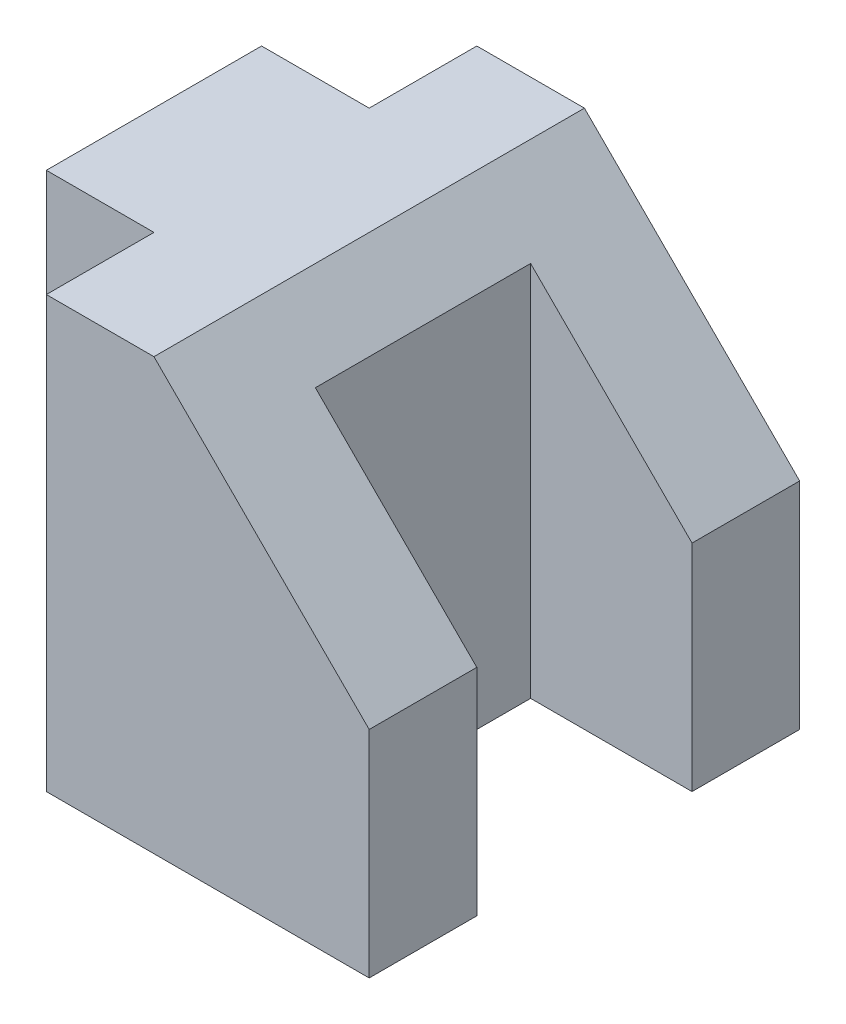
ISO-10303-21;
HEADER;
FILE_DESCRIPTION(('STEP AP214'),'2;1');
FILE_NAME('part.step','',(''),(''),'','','');
FILE_SCHEMA(('AUTOMOTIVE_DESIGN { 1 0 10303 214 1 1 1 1 }'));
ENDSEC;
DATA;
#1=APPLICATION_CONTEXT('core data for automotive mechanical design processes');
#2=APPLICATION_PROTOCOL_DEFINITION('international standard','automotive_design',2000,#1);
#3=PRODUCT_CONTEXT('',#1,'mechanical');
#4=PRODUCT('Part','Part','',(#3));
#5=PRODUCT_RELATED_PRODUCT_CATEGORY('part','',(#4));
#6=PRODUCT_DEFINITION_FORMATION('','',#4);
#7=PRODUCT_DEFINITION_CONTEXT('part definition',#1,'design');
#8=PRODUCT_DEFINITION('design','',#6,#7);
#9=PRODUCT_DEFINITION_SHAPE('','',#8);
#10=(LENGTH_UNIT() NAMED_UNIT(*) SI_UNIT(.MILLI.,.METRE.));
#11=(NAMED_UNIT(*) PLANE_ANGLE_UNIT() SI_UNIT($,.RADIAN.));
#12=(NAMED_UNIT(*) SI_UNIT($,.STERADIAN.) SOLID_ANGLE_UNIT());
#13=UNCERTAINTY_MEASURE_WITH_UNIT(LENGTH_MEASURE(1.E-05),#10,'distance_accuracy_value','');
#14=(GEOMETRIC_REPRESENTATION_CONTEXT(3) GLOBAL_UNCERTAINTY_ASSIGNED_CONTEXT((#13)) GLOBAL_UNIT_ASSIGNED_CONTEXT((#10,
#11,#12)) REPRESENTATION_CONTEXT('',''));
#15=CARTESIAN_POINT('',(0.,0.,0.));
#16=DIRECTION('',(0.,0.,1.));
#17=DIRECTION('',(1.,0.,0.));
#18=AXIS2_PLACEMENT_3D('',#15,#16,#17);
#19=CARTESIAN_POINT('',(38.1,101.6,-25.4));
#20=DIRECTION('',(-1.,0.,0.));
#21=DIRECTION('',(0.,0.,1.));
#22=AXIS2_PLACEMENT_3D('',#19,#20,#21);
#23=PLANE('',#22);
#24=DIRECTION('',(0.,-1.,0.));
#25=VECTOR('',#24,1.);
#26=CARTESIAN_POINT('',(38.1,101.6,-25.4));
#27=LINE('',#26,#25);
#28=CARTESIAN_POINT('',(38.1,50.8,-25.4));
#29=VERTEX_POINT('',#28);
#30=CARTESIAN_POINT('',(38.1,0.,-25.4));
#31=VERTEX_POINT('',#30);
#32=EDGE_CURVE('E47',#29,#31,#27,.T.);
#33=ORIENTED_EDGE('',*,*,#32,.F.);
#34=DIRECTION('',(0.,0.,1.));
#35=VECTOR('',#34,1.);
#36=CARTESIAN_POINT('',(38.1,50.8,-101.6));
#37=LINE('',#36,#35);
#38=CARTESIAN_POINT('',(38.1,50.8,0.));
#39=VERTEX_POINT('',#38);
#40=EDGE_CURVE('E273',#29,#39,#37,.T.);
#41=ORIENTED_EDGE('',*,*,#40,.T.);
#42=DIRECTION('',(0.,-1.,0.));
#43=VECTOR('',#42,1.);
#44=CARTESIAN_POINT('',(38.1,101.6,0.));
#45=LINE('',#44,#43);
#46=CARTESIAN_POINT('',(38.1,0.,0.));
#47=VERTEX_POINT('',#46);
#48=EDGE_CURVE('E11',#39,#47,#45,.T.);
#49=ORIENTED_EDGE('',*,*,#48,.T.);
#50=DIRECTION('',(0.,0.,-1.));
#51=VECTOR('',#50,1.);
#52=CARTESIAN_POINT('',(38.1,0.,-25.4));
#53=LINE('',#52,#51);
#54=EDGE_CURVE('E160',#47,#31,#53,.T.);
#55=ORIENTED_EDGE('',*,*,#54,.T.);
#56=EDGE_LOOP('',(#33,#41,#49,#55));
#57=FACE_BOUND('',#56,.T.);
#58=ADVANCED_FACE('F39',(#57),#23,.F.);
#59=CARTESIAN_POINT('',(0.,101.6,-25.4));
#60=DIRECTION('',(0.,0.,1.));
#61=DIRECTION('',(1.,0.,0.));
#62=AXIS2_PLACEMENT_3D('',#59,#60,#61);
#63=PLANE('',#62);
#64=DIRECTION('',(0.,-1.,0.));
#65=VECTOR('',#64,1.);
#66=CARTESIAN_POINT('',(0.,101.6,-25.4));
#67=LINE('',#66,#65);
#68=CARTESIAN_POINT('',(0.,88.9,-25.4));
#69=VERTEX_POINT('',#68);
#70=CARTESIAN_POINT('',(0.,0.,-25.4));
#71=VERTEX_POINT('',#70);
#72=EDGE_CURVE('E224',#69,#71,#67,.T.);
#73=ORIENTED_EDGE('',*,*,#72,.F.);
#74=DIRECTION('',(0.707106781186548,-0.707106781186548,0.));
#75=VECTOR('',#74,1.);
#76=CARTESIAN_POINT('',(-6.34999999999999,95.25,-25.4));
#77=LINE('',#76,#75);
#78=EDGE_CURVE('E165',#69,#29,#77,.T.);
#79=ORIENTED_EDGE('',*,*,#78,.T.);
#80=ORIENTED_EDGE('',*,*,#32,.T.);
#81=DIRECTION('',(-1.,0.,0.));
#82=VECTOR('',#81,1.);
#83=CARTESIAN_POINT('',(0.,0.,-25.4));
#84=LINE('',#83,#82);
#85=EDGE_CURVE('E164',#31,#71,#84,.T.);
#86=ORIENTED_EDGE('',*,*,#85,.T.);
#87=EDGE_LOOP('',(#73,#79,#80,#86));
#88=FACE_BOUND('',#87,.T.);
#89=ADVANCED_FACE('F231',(#88),#63,.F.);
#90=CARTESIAN_POINT('',(0.,101.6,-76.2));
#91=DIRECTION('',(-1.,0.,0.));
#92=DIRECTION('',(0.,0.,1.));
#93=AXIS2_PLACEMENT_3D('',#90,#91,#92);
#94=PLANE('',#93);
#95=DIRECTION('',(0.,-1.,0.));
#96=VECTOR('',#95,1.);
#97=CARTESIAN_POINT('',(0.,101.6,-76.2));
#98=LINE('',#97,#96);
#99=CARTESIAN_POINT('',(0.,88.9,-76.2));
#100=VERTEX_POINT('',#99);
#101=CARTESIAN_POINT('',(0.,0.,-76.2));
#102=VERTEX_POINT('',#101);
#103=EDGE_CURVE('E221',#100,#102,#98,.T.);
#104=ORIENTED_EDGE('',*,*,#103,.F.);
#105=DIRECTION('',(0.,0.,1.));
#106=VECTOR('',#105,1.);
#107=CARTESIAN_POINT('',(0.,88.9,-76.2));
#108=LINE('',#107,#106);
#109=EDGE_CURVE('E251',#100,#69,#108,.T.);
#110=ORIENTED_EDGE('',*,*,#109,.T.);
#111=ORIENTED_EDGE('',*,*,#72,.T.);
#112=DIRECTION('',(0.,0.,-1.));
#113=VECTOR('',#112,1.);
#114=CARTESIAN_POINT('',(0.,0.,-76.2));
#115=LINE('',#114,#113);
#116=EDGE_CURVE('E169',#71,#102,#115,.T.);
#117=ORIENTED_EDGE('',*,*,#116,.T.);
#118=EDGE_LOOP('',(#104,#110,#111,#117));
#119=FACE_BOUND('',#118,.T.);
#120=ADVANCED_FACE('F247',(#119),#94,.F.);
#121=CARTESIAN_POINT('',(38.1,101.6,-76.2));
#122=DIRECTION('',(0.,0.,-1.));
#123=DIRECTION('',(-1.,0.,0.));
#124=AXIS2_PLACEMENT_3D('',#121,#122,#123);
#125=PLANE('',#124);
#126=DIRECTION('',(0.,-1.,0.));
#127=VECTOR('',#126,1.);
#128=CARTESIAN_POINT('',(38.1,101.6,-76.2));
#129=LINE('',#128,#127);
#130=CARTESIAN_POINT('',(38.1,50.8,-76.2));
#131=VERTEX_POINT('',#130);
#132=CARTESIAN_POINT('',(38.1,0.,-76.2));
#133=VERTEX_POINT('',#132);
#134=EDGE_CURVE('E218',#131,#133,#129,.T.);
#135=ORIENTED_EDGE('',*,*,#134,.F.);
#136=DIRECTION('',(-0.707106781186548,0.707106781186548,0.));
#137=VECTOR('',#136,1.);
#138=CARTESIAN_POINT('',(12.7,76.2,-76.2));
#139=LINE('',#138,#137);
#140=EDGE_CURVE('E268',#131,#100,#139,.T.);
#141=ORIENTED_EDGE('',*,*,#140,.T.);
#142=ORIENTED_EDGE('',*,*,#103,.T.);
#143=DIRECTION('',(1.,0.,0.));
#144=VECTOR('',#143,1.);
#145=CARTESIAN_POINT('',(38.1,0.,-76.2));
#146=LINE('',#145,#144);
#147=EDGE_CURVE('E173',#102,#133,#146,.T.);
#148=ORIENTED_EDGE('',*,*,#147,.T.);
#149=EDGE_LOOP('',(#135,#141,#142,#148));
#150=FACE_BOUND('',#149,.T.);
#151=ADVANCED_FACE('F325',(#150),#125,.F.);
#152=CARTESIAN_POINT('',(38.1,101.6,-101.6));
#153=DIRECTION('',(-1.,0.,0.));
#154=DIRECTION('',(0.,0.,1.));
#155=AXIS2_PLACEMENT_3D('',#152,#153,#154);
#156=PLANE('',#155);
#157=DIRECTION('',(0.,-1.,0.));
#158=VECTOR('',#157,1.);
#159=CARTESIAN_POINT('',(38.1,101.6,-101.6));
#160=LINE('',#159,#158);
#161=CARTESIAN_POINT('',(38.1,50.8,-101.6));
#162=VERTEX_POINT('',#161);
#163=CARTESIAN_POINT('',(38.1,0.,-101.6));
#164=VERTEX_POINT('',#163);
#165=EDGE_CURVE('E215',#162,#164,#160,.T.);
#166=ORIENTED_EDGE('',*,*,#165,.F.);
#167=EDGE_CURVE('E266',#162,#131,#37,.T.);
#168=ORIENTED_EDGE('',*,*,#167,.T.);
#169=ORIENTED_EDGE('',*,*,#134,.T.);
#170=DIRECTION('',(0.,0.,-1.));
#171=VECTOR('',#170,1.);
#172=CARTESIAN_POINT('',(38.1,0.,-101.6));
#173=LINE('',#172,#171);
#174=EDGE_CURVE('E177',#133,#164,#173,.T.);
#175=ORIENTED_EDGE('',*,*,#174,.T.);
#176=EDGE_LOOP('',(#166,#168,#169,#175));
#177=FACE_BOUND('',#176,.T.);
#178=ADVANCED_FACE('F281',(#177),#156,.F.);
#179=CARTESIAN_POINT('',(-38.1,101.6,-101.6));
#180=DIRECTION('',(0.,0.,1.));
#181=DIRECTION('',(1.,0.,0.));
#182=AXIS2_PLACEMENT_3D('',#179,#180,#181);
#183=PLANE('',#182);
#184=DIRECTION('',(-1.,0.,0.));
#185=VECTOR('',#184,1.);
#186=CARTESIAN_POINT('',(-38.1,101.6,-101.6));
#187=LINE('',#186,#185);
#188=CARTESIAN_POINT('',(-12.7,101.6,-101.6));
#189=VERTEX_POINT('',#188);
#190=CARTESIAN_POINT('',(-38.1,101.6,-101.6));
#191=VERTEX_POINT('',#190);
#192=EDGE_CURVE('E116',#189,#191,#187,.T.);
#193=ORIENTED_EDGE('',*,*,#192,.F.);
#194=DIRECTION('',(0.707106781186547,-0.707106781186547,0.));
#195=VECTOR('',#194,1.);
#196=CARTESIAN_POINT('',(-12.7,101.6,-101.6));
#197=LINE('',#196,#195);
#198=EDGE_CURVE('E54',#189,#162,#197,.T.);
#199=ORIENTED_EDGE('',*,*,#198,.T.);
#200=ORIENTED_EDGE('',*,*,#165,.T.);
#201=DIRECTION('',(-1.,0.,0.));
#202=VECTOR('',#201,1.);
#203=CARTESIAN_POINT('',(-38.1,0.,-101.6));
#204=LINE('',#203,#202);
#205=CARTESIAN_POINT('',(-38.1,0.,-101.6));
#206=VERTEX_POINT('',#205);
#207=EDGE_CURVE('E181',#164,#206,#204,.T.);
#208=ORIENTED_EDGE('',*,*,#207,.T.);
#209=DIRECTION('',(0.,-1.,0.));
#210=VECTOR('',#209,1.);
#211=CARTESIAN_POINT('',(-38.1,101.6,-101.6));
#212=LINE('',#211,#210);
#213=EDGE_CURVE('E211',#191,#206,#212,.T.);
#214=ORIENTED_EDGE('',*,*,#213,.F.);
#215=EDGE_LOOP('',(#193,#199,#200,#208,#214));
#216=FACE_BOUND('',#215,.T.);
#217=ADVANCED_FACE('F276',(#216),#183,.F.);
#218=CARTESIAN_POINT('',(-38.1,101.6,-76.2));
#219=DIRECTION('',(1.,0.,0.));
#220=DIRECTION('',(0.,0.,-1.));
#221=AXIS2_PLACEMENT_3D('',#218,#219,#220);
#222=PLANE('',#221);
#223=DIRECTION('',(0.,0.,1.));
#224=VECTOR('',#223,1.);
#225=CARTESIAN_POINT('',(-38.1,0.,-76.2));
#226=LINE('',#225,#224);
#227=CARTESIAN_POINT('',(-38.1,0.,-76.2));
#228=VERTEX_POINT('',#227);
#229=EDGE_CURVE('E184',#206,#228,#226,.T.);
#230=ORIENTED_EDGE('',*,*,#229,.T.);
#231=DIRECTION('',(0.,-1.,0.));
#232=VECTOR('',#231,1.);
#233=CARTESIAN_POINT('',(-38.1,101.6,-76.2));
#234=LINE('',#233,#232);
#235=CARTESIAN_POINT('',(-38.1,101.6,-76.2));
#236=VERTEX_POINT('',#235);
#237=EDGE_CURVE('E207',#236,#228,#234,.T.);
#238=ORIENTED_EDGE('',*,*,#237,.F.);
#239=DIRECTION('',(0.,0.,1.));
#240=VECTOR('',#239,1.);
#241=CARTESIAN_POINT('',(-38.1,101.6,-76.2));
#242=LINE('',#241,#240);
#243=EDGE_CURVE('E289',#191,#236,#242,.T.);
#244=ORIENTED_EDGE('',*,*,#243,.F.);
#245=ORIENTED_EDGE('',*,*,#213,.T.);
#246=EDGE_LOOP('',(#230,#238,#244,#245));
#247=FACE_BOUND('',#246,.T.);
#248=ADVANCED_FACE('F287',(#247),#222,.F.);
#249=CARTESIAN_POINT('',(-63.5,101.6,-76.2));
#250=DIRECTION('',(0.,0.,1.));
#251=DIRECTION('',(1.,0.,0.));
#252=AXIS2_PLACEMENT_3D('',#249,#250,#251);
#253=PLANE('',#252);
#254=DIRECTION('',(-1.,0.,0.));
#255=VECTOR('',#254,1.);
#256=CARTESIAN_POINT('',(-63.5,0.,-76.2));
#257=LINE('',#256,#255);
#258=CARTESIAN_POINT('',(-63.5,0.,-76.2));
#259=VERTEX_POINT('',#258);
#260=EDGE_CURVE('E187',#228,#259,#257,.T.);
#261=ORIENTED_EDGE('',*,*,#260,.T.);
#262=DIRECTION('',(0.,-1.,0.));
#263=VECTOR('',#262,1.);
#264=CARTESIAN_POINT('',(-63.5,101.6,-76.2));
#265=LINE('',#264,#263);
#266=CARTESIAN_POINT('',(-63.5,101.6,-76.2));
#267=VERTEX_POINT('',#266);
#268=EDGE_CURVE('E147',#267,#259,#265,.T.);
#269=ORIENTED_EDGE('',*,*,#268,.F.);
#270=DIRECTION('',(-1.,0.,0.));
#271=VECTOR('',#270,1.);
#272=CARTESIAN_POINT('',(-63.5,101.6,-76.2));
#273=LINE('',#272,#271);
#274=EDGE_CURVE('E133',#236,#267,#273,.T.);
#275=ORIENTED_EDGE('',*,*,#274,.F.);
#276=ORIENTED_EDGE('',*,*,#237,.T.);
#277=EDGE_LOOP('',(#261,#269,#275,#276));
#278=FACE_BOUND('',#277,.T.);
#279=ADVANCED_FACE('F337',(#278),#253,.F.);
#280=CARTESIAN_POINT('',(-63.5,101.6,-25.4));
#281=DIRECTION('',(1.,0.,0.));
#282=DIRECTION('',(0.,0.,-1.));
#283=AXIS2_PLACEMENT_3D('',#280,#281,#282);
#284=PLANE('',#283);
#285=DIRECTION('',(0.,0.,1.));
#286=VECTOR('',#285,1.);
#287=CARTESIAN_POINT('',(-63.5,0.,-25.4));
#288=LINE('',#287,#286);
#289=CARTESIAN_POINT('',(-63.5,0.,-25.4));
#290=VERTEX_POINT('',#289);
#291=EDGE_CURVE('E143',#259,#290,#288,.T.);
#292=ORIENTED_EDGE('',*,*,#291,.T.);
#293=DIRECTION('',(0.,-1.,0.));
#294=VECTOR('',#293,1.);
#295=CARTESIAN_POINT('',(-63.5,101.6,-25.4));
#296=LINE('',#295,#294);
#297=CARTESIAN_POINT('',(-63.5,101.6,-25.4));
#298=VERTEX_POINT('',#297);
#299=EDGE_CURVE('E140',#298,#290,#296,.T.);
#300=ORIENTED_EDGE('',*,*,#299,.F.);
#301=DIRECTION('',(0.,0.,1.));
#302=VECTOR('',#301,1.);
#303=CARTESIAN_POINT('',(-63.5,101.6,-25.4));
#304=LINE('',#303,#302);
#305=EDGE_CURVE('E126',#267,#298,#304,.T.);
#306=ORIENTED_EDGE('',*,*,#305,.F.);
#307=ORIENTED_EDGE('',*,*,#268,.T.);
#308=EDGE_LOOP('',(#292,#300,#306,#307));
#309=FACE_BOUND('',#308,.T.);
#310=ADVANCED_FACE('F141',(#309),#284,.F.);
#311=CARTESIAN_POINT('',(-38.1,101.6,-25.4));
#312=DIRECTION('',(0.,0.,-1.));
#313=DIRECTION('',(-1.,0.,0.));
#314=AXIS2_PLACEMENT_3D('',#311,#312,#313);
#315=PLANE('',#314);
#316=DIRECTION('',(1.,0.,0.));
#317=VECTOR('',#316,1.);
#318=CARTESIAN_POINT('',(-38.1,0.,-25.4));
#319=LINE('',#318,#317);
#320=CARTESIAN_POINT('',(-38.1,0.,-25.4));
#321=VERTEX_POINT('',#320);
#322=EDGE_CURVE('E192',#290,#321,#319,.T.);
#323=ORIENTED_EDGE('',*,*,#322,.T.);
#324=DIRECTION('',(0.,-1.,0.));
#325=VECTOR('',#324,1.);
#326=CARTESIAN_POINT('',(-38.1,101.6,-25.4));
#327=LINE('',#326,#325);
#328=CARTESIAN_POINT('',(-38.1,101.6,-25.4));
#329=VERTEX_POINT('',#328);
#330=EDGE_CURVE('E148',#329,#321,#327,.T.);
#331=ORIENTED_EDGE('',*,*,#330,.F.);
#332=DIRECTION('',(1.,0.,0.));
#333=VECTOR('',#332,1.);
#334=CARTESIAN_POINT('',(-38.1,101.6,-25.4));
#335=LINE('',#334,#333);
#336=EDGE_CURVE('E130',#298,#329,#335,.T.);
#337=ORIENTED_EDGE('',*,*,#336,.F.);
#338=ORIENTED_EDGE('',*,*,#299,.T.);
#339=EDGE_LOOP('',(#323,#331,#337,#338));
#340=FACE_BOUND('',#339,.T.);
#341=ADVANCED_FACE('F150',(#340),#315,.F.);
#342=CARTESIAN_POINT('',(-38.1,101.6,0.));
#343=DIRECTION('',(1.,0.,0.));
#344=DIRECTION('',(0.,0.,-1.));
#345=AXIS2_PLACEMENT_3D('',#342,#343,#344);
#346=PLANE('',#345);
#347=DIRECTION('',(0.,0.,1.));
#348=VECTOR('',#347,1.);
#349=CARTESIAN_POINT('',(-38.1,0.,0.));
#350=LINE('',#349,#348);
#351=CARTESIAN_POINT('',(-38.1,0.,0.));
#352=VERTEX_POINT('',#351);
#353=EDGE_CURVE('E109',#321,#352,#350,.T.);
#354=ORIENTED_EDGE('',*,*,#353,.T.);
#355=DIRECTION('',(0.,-1.,0.));
#356=VECTOR('',#355,1.);
#357=CARTESIAN_POINT('',(-38.1,101.6,0.));
#358=LINE('',#357,#356);
#359=CARTESIAN_POINT('',(-38.1,101.6,0.));
#360=VERTEX_POINT('',#359);
#361=EDGE_CURVE('E156',#360,#352,#358,.T.);
#362=ORIENTED_EDGE('',*,*,#361,.F.);
#363=DIRECTION('',(0.,0.,1.));
#364=VECTOR('',#363,1.);
#365=CARTESIAN_POINT('',(-38.1,101.6,0.));
#366=LINE('',#365,#364);
#367=EDGE_CURVE('E153',#329,#360,#366,.T.);
#368=ORIENTED_EDGE('',*,*,#367,.F.);
#369=ORIENTED_EDGE('',*,*,#330,.T.);
#370=EDGE_LOOP('',(#354,#362,#368,#369));
#371=FACE_BOUND('',#370,.T.);
#372=ADVANCED_FACE('F309',(#371),#346,.F.);
#373=CARTESIAN_POINT('',(0.,101.6,0.));
#374=DIRECTION('',(0.,0.,-1.));
#375=DIRECTION('',(-1.,0.,0.));
#376=AXIS2_PLACEMENT_3D('',#373,#374,#375);
#377=PLANE('',#376);
#378=ORIENTED_EDGE('',*,*,#48,.F.);
#379=DIRECTION('',(0.707106781186547,-0.707106781186547,0.));
#380=VECTOR('',#379,1.);
#381=CARTESIAN_POINT('',(-12.7,101.6,0.));
#382=LINE('',#381,#380);
#383=CARTESIAN_POINT('',(-12.7,101.6,0.));
#384=VERTEX_POINT('',#383);
#385=EDGE_CURVE('E279',#384,#39,#382,.T.);
#386=ORIENTED_EDGE('',*,*,#385,.F.);
#387=DIRECTION('',(1.,0.,0.));
#388=VECTOR('',#387,1.);
#389=CARTESIAN_POINT('',(38.1,101.6,0.));
#390=LINE('',#389,#388);
#391=EDGE_CURVE('E63',#360,#384,#390,.T.);
#392=ORIENTED_EDGE('',*,*,#391,.F.);
#393=ORIENTED_EDGE('',*,*,#361,.T.);
#394=DIRECTION('',(1.,0.,0.));
#395=VECTOR('',#394,1.);
#396=CARTESIAN_POINT('',(0.,0.,0.));
#397=LINE('',#396,#395);
#398=EDGE_CURVE('E197',#352,#47,#397,.T.);
#399=ORIENTED_EDGE('',*,*,#398,.T.);
#400=EDGE_LOOP('',(#378,#386,#392,#393,#399));
#401=FACE_BOUND('',#400,.T.);
#402=ADVANCED_FACE('F308',(#401),#377,.F.);
#403=CARTESIAN_POINT('',(0.,101.6,0.));
#404=DIRECTION('',(0.,-1.,0.));
#405=DIRECTION('',(0.,0.,-1.));
#406=AXIS2_PLACEMENT_3D('',#403,#404,#405);
#407=PLANE('',#406);
#408=ORIENTED_EDGE('',*,*,#391,.T.);
#409=DIRECTION('',(0.,0.,1.));
#410=VECTOR('',#409,1.);
#411=CARTESIAN_POINT('',(-12.7,101.6,-101.6));
#412=LINE('',#411,#410);
#413=EDGE_CURVE('E278',#189,#384,#412,.T.);
#414=ORIENTED_EDGE('',*,*,#413,.F.);
#415=ORIENTED_EDGE('',*,*,#192,.T.);
#416=ORIENTED_EDGE('',*,*,#243,.T.);
#417=ORIENTED_EDGE('',*,*,#274,.T.);
#418=ORIENTED_EDGE('',*,*,#305,.T.);
#419=ORIENTED_EDGE('',*,*,#336,.T.);
#420=ORIENTED_EDGE('',*,*,#367,.T.);
#421=EDGE_LOOP('',(#408,#414,#415,#416,#417,#418,#419,#420));
#422=FACE_BOUND('',#421,.T.);
#423=ADVANCED_FACE('F128',(#422),#407,.F.);
#424=CARTESIAN_POINT('',(0.,0.,0.));
#425=DIRECTION('',(0.,-1.,0.));
#426=DIRECTION('',(0.,0.,-1.));
#427=AXIS2_PLACEMENT_3D('',#424,#425,#426);
#428=PLANE('',#427);
#429=ORIENTED_EDGE('',*,*,#54,.F.);
#430=ORIENTED_EDGE('',*,*,#398,.F.);
#431=ORIENTED_EDGE('',*,*,#353,.F.);
#432=ORIENTED_EDGE('',*,*,#322,.F.);
#433=ORIENTED_EDGE('',*,*,#291,.F.);
#434=ORIENTED_EDGE('',*,*,#260,.F.);
#435=ORIENTED_EDGE('',*,*,#229,.F.);
#436=ORIENTED_EDGE('',*,*,#207,.F.);
#437=ORIENTED_EDGE('',*,*,#174,.F.);
#438=ORIENTED_EDGE('',*,*,#147,.F.);
#439=ORIENTED_EDGE('',*,*,#116,.F.);
#440=ORIENTED_EDGE('',*,*,#85,.F.);
#441=EDGE_LOOP('',(#429,#430,#431,#432,#433,#434,#435,#436,#437,#438,#439,#440));
#442=FACE_BOUND('',#441,.T.);
#443=ADVANCED_FACE('F242',(#442),#428,.T.);
#444=CARTESIAN_POINT('',(-12.7,101.6,-101.6));
#445=DIRECTION('',(-0.707106781186548,-0.707106781186548,0.));
#446=DIRECTION('',(0.707106781186548,-0.707106781186548,0.));
#447=AXIS2_PLACEMENT_3D('',#444,#445,#446);
#448=PLANE('',#447);
#449=ORIENTED_EDGE('',*,*,#109,.F.);
#450=ORIENTED_EDGE('',*,*,#140,.F.);
#451=ORIENTED_EDGE('',*,*,#167,.F.);
#452=ORIENTED_EDGE('',*,*,#198,.F.);
#453=ORIENTED_EDGE('',*,*,#413,.T.);
#454=ORIENTED_EDGE('',*,*,#385,.T.);
#455=ORIENTED_EDGE('',*,*,#40,.F.);
#456=ORIENTED_EDGE('',*,*,#78,.F.);
#457=EDGE_LOOP('',(#449,#450,#451,#452,#453,#454,#455,#456));
#458=FACE_BOUND('',#457,.T.);
#459=ADVANCED_FACE('F267',(#458),#448,.F.);
#460=CLOSED_SHELL('',(#58,#89,#120,#151,#178,#217,#248,#279,#310,#341,#372,#402,#423,#443,#459));
#461=MANIFOLD_SOLID_BREP('B2',#460);
#462=ADVANCED_BREP_SHAPE_REPRESENTATION('',(#18,#461),#14);
#463=SHAPE_DEFINITION_REPRESENTATION(#9,#462);
ENDSEC;
END-ISO-10303-21;
